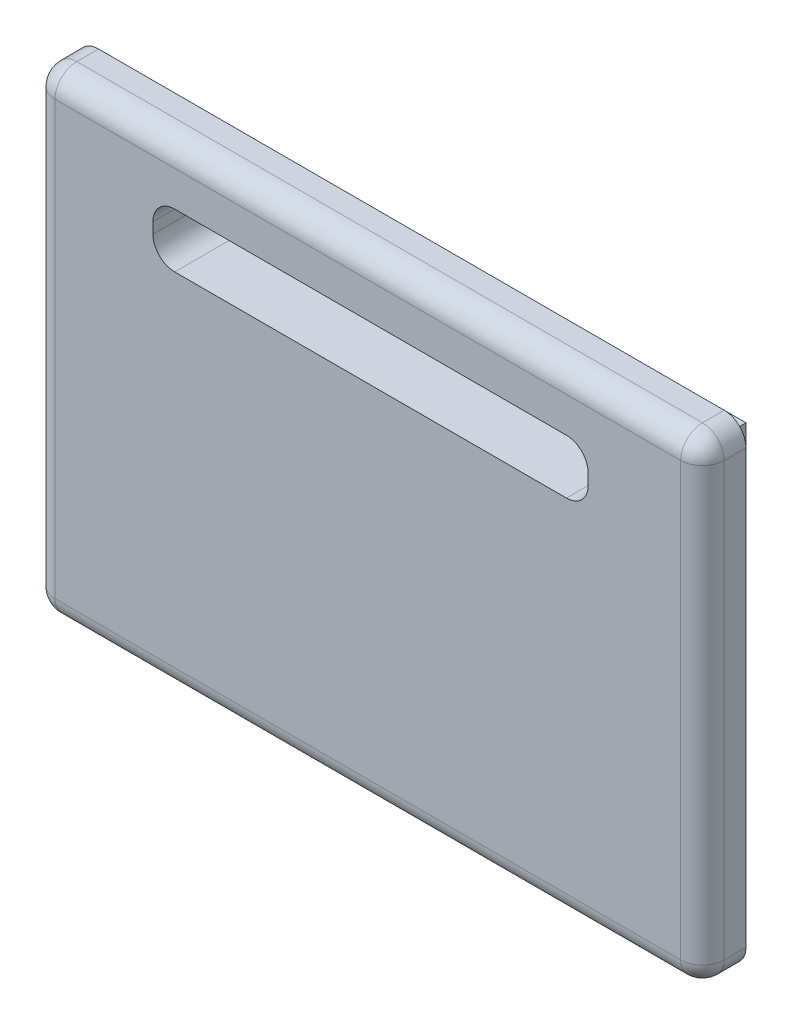
ISO-10303-21;
HEADER;
FILE_DESCRIPTION(('STEP AP214'),'2;1');
FILE_NAME('part.step','',(''),(''),'','','');
FILE_SCHEMA(('AUTOMOTIVE_DESIGN { 1 0 10303 214 1 1 1 1 }'));
ENDSEC;
DATA;
#1=APPLICATION_CONTEXT('core data for automotive mechanical design processes');
#2=APPLICATION_PROTOCOL_DEFINITION('international standard','automotive_design',2000,#1);
#3=PRODUCT_CONTEXT('',#1,'mechanical');
#4=PRODUCT('Part','Part','',(#3));
#5=PRODUCT_RELATED_PRODUCT_CATEGORY('part','',(#4));
#6=PRODUCT_DEFINITION_FORMATION('','',#4);
#7=PRODUCT_DEFINITION_CONTEXT('part definition',#1,'design');
#8=PRODUCT_DEFINITION('design','',#6,#7);
#9=PRODUCT_DEFINITION_SHAPE('','',#8);
#10=(LENGTH_UNIT() NAMED_UNIT(*) SI_UNIT(.MILLI.,.METRE.));
#11=(NAMED_UNIT(*) PLANE_ANGLE_UNIT() SI_UNIT($,.RADIAN.));
#12=(NAMED_UNIT(*) SI_UNIT($,.STERADIAN.) SOLID_ANGLE_UNIT());
#13=UNCERTAINTY_MEASURE_WITH_UNIT(LENGTH_MEASURE(1.E-05),#10,'distance_accuracy_value','');
#14=(GEOMETRIC_REPRESENTATION_CONTEXT(3) GLOBAL_UNCERTAINTY_ASSIGNED_CONTEXT((#13)) GLOBAL_UNIT_ASSIGNED_CONTEXT((#10,
#11,#12)) REPRESENTATION_CONTEXT('',''));
#15=CARTESIAN_POINT('',(0.,0.,0.));
#16=DIRECTION('',(0.,0.,1.));
#17=DIRECTION('',(1.,0.,0.));
#18=AXIS2_PLACEMENT_3D('',#15,#16,#17);
#19=CARTESIAN_POINT('',(0.,0.,0.));
#20=DIRECTION('',(0.,0.,1.));
#21=DIRECTION('',(1.,0.,0.));
#22=AXIS2_PLACEMENT_3D('',#19,#20,#21);
#23=PLANE('',#22);
#24=DIRECTION('',(0.,-1.,0.));
#25=VECTOR('',#24,1.);
#26=CARTESIAN_POINT('',(-21.5226912327314,22.8150411802114,0.));
#27=LINE('',#26,#25);
#28=CARTESIAN_POINT('',(-21.5226912327314,20.8150411802114,0.));
#29=VERTEX_POINT('',#28);
#30=CARTESIAN_POINT('',(-21.5226912327314,-18.9349588197886,0.));
#31=VERTEX_POINT('',#30);
#32=EDGE_CURVE('E208',#29,#31,#27,.T.);
#33=ORIENTED_EDGE('',*,*,#32,.F.);
#34=CARTESIAN_POINT('',(-19.5226912327314,20.8150411802114,0.));
#35=DIRECTION('',(0.,0.,1.));
#36=DIRECTION('',(1.,0.,0.));
#37=AXIS2_PLACEMENT_3D('',#34,#35,#36);
#38=CIRCLE('',#37,2.);
#39=CARTESIAN_POINT('',(-19.5226912327314,22.8150411802114,0.));
#40=VERTEX_POINT('',#39);
#41=EDGE_CURVE('E265',#29,#40,#38,.F.);
#42=ORIENTED_EDGE('',*,*,#41,.T.);
#43=DIRECTION('',(-1.,0.,0.));
#44=VECTOR('',#43,1.);
#45=CARTESIAN_POINT('',(-21.5226912327314,22.8150411802114,0.));
#46=LINE('',#45,#44);
#47=CARTESIAN_POINT('',(37.9773087672686,22.8150411802114,0.));
#48=VERTEX_POINT('',#47);
#49=EDGE_CURVE('E222',#48,#40,#46,.T.);
#50=ORIENTED_EDGE('',*,*,#49,.F.);
#51=CARTESIAN_POINT('',(37.9773087672686,20.8150411802114,0.));
#52=DIRECTION('',(0.,0.,1.));
#53=DIRECTION('',(1.,0.,0.));
#54=AXIS2_PLACEMENT_3D('',#51,#52,#53);
#55=CIRCLE('',#54,2.);
#56=CARTESIAN_POINT('',(39.9773087672686,20.8150411802114,0.));
#57=VERTEX_POINT('',#56);
#58=EDGE_CURVE('E259',#48,#57,#55,.F.);
#59=ORIENTED_EDGE('',*,*,#58,.T.);
#60=DIRECTION('',(0.,1.,0.));
#61=VECTOR('',#60,1.);
#62=CARTESIAN_POINT('',(39.9773087672686,22.8150411802114,0.));
#63=LINE('',#62,#61);
#64=CARTESIAN_POINT('',(39.9773087672686,-18.9349588197886,0.));
#65=VERTEX_POINT('',#64);
#66=EDGE_CURVE('E219',#65,#57,#63,.T.);
#67=ORIENTED_EDGE('',*,*,#66,.F.);
#68=CARTESIAN_POINT('',(37.9773087672686,-18.9349588197886,0.));
#69=DIRECTION('',(0.,0.,1.));
#70=DIRECTION('',(1.,0.,0.));
#71=AXIS2_PLACEMENT_3D('',#68,#69,#70);
#72=CIRCLE('',#71,2.);
#73=CARTESIAN_POINT('',(37.9773087672686,-20.9349588197886,0.));
#74=VERTEX_POINT('',#73);
#75=EDGE_CURVE('E261',#65,#74,#72,.F.);
#76=ORIENTED_EDGE('',*,*,#75,.T.);
#77=DIRECTION('',(1.,0.,0.));
#78=VECTOR('',#77,1.);
#79=CARTESIAN_POINT('',(-21.5226912327314,-20.9349588197886,0.));
#80=LINE('',#79,#78);
#81=CARTESIAN_POINT('',(-19.5226912327314,-20.9349588197886,0.));
#82=VERTEX_POINT('',#81);
#83=EDGE_CURVE('E211',#82,#74,#80,.T.);
#84=ORIENTED_EDGE('',*,*,#83,.F.);
#85=CARTESIAN_POINT('',(-19.5226912327314,-18.9349588197886,0.));
#86=DIRECTION('',(0.,0.,1.));
#87=DIRECTION('',(1.,0.,0.));
#88=AXIS2_PLACEMENT_3D('',#85,#86,#87);
#89=CIRCLE('',#88,2.);
#90=EDGE_CURVE('E263',#82,#31,#89,.F.);
#91=ORIENTED_EDGE('',*,*,#90,.T.);
#92=EDGE_LOOP('',(#33,#42,#50,#59,#67,#76,#84,#91));
#93=FACE_BOUND('',#92,.T.);
#94=DIRECTION('',(0.,1.,0.));
#95=VECTOR('',#94,1.);
#96=CARTESIAN_POINT('',(-17.5226912327314,-16.9349588197886,0.));
#97=LINE('',#96,#95);
#98=CARTESIAN_POINT('',(-17.5226912327314,-16.9349588197886,0.));
#99=VERTEX_POINT('',#98);
#100=CARTESIAN_POINT('',(-17.5226912327314,18.8150411802114,0.));
#101=VERTEX_POINT('',#100);
#102=EDGE_CURVE('E207',#99,#101,#97,.T.);
#103=ORIENTED_EDGE('',*,*,#102,.F.);
#104=DIRECTION('',(-1.,0.,0.));
#105=VECTOR('',#104,1.);
#106=CARTESIAN_POINT('',(-17.5226912327314,-16.9349588197886,0.));
#107=LINE('',#106,#105);
#108=CARTESIAN_POINT('',(35.9773087672686,-16.9349588197886,0.));
#109=VERTEX_POINT('',#108);
#110=EDGE_CURVE('E204',#109,#99,#107,.T.);
#111=ORIENTED_EDGE('',*,*,#110,.F.);
#112=DIRECTION('',(0.,-1.,0.));
#113=VECTOR('',#112,1.);
#114=CARTESIAN_POINT('',(35.9773087672686,-16.9349588197886,0.));
#115=LINE('',#114,#113);
#116=CARTESIAN_POINT('',(35.9773087672686,18.8150411802114,0.));
#117=VERTEX_POINT('',#116);
#118=EDGE_CURVE('E374',#117,#109,#115,.T.);
#119=ORIENTED_EDGE('',*,*,#118,.F.);
#120=DIRECTION('',(1.,0.,0.));
#121=VECTOR('',#120,1.);
#122=CARTESIAN_POINT('',(-17.5226912327314,18.8150411802114,0.));
#123=LINE('',#122,#121);
#124=EDGE_CURVE('E372',#101,#117,#123,.T.);
#125=ORIENTED_EDGE('',*,*,#124,.F.);
#126=EDGE_LOOP('',(#103,#111,#119,#125));
#127=FACE_BOUND('',#126,.T.);
#128=ADVANCED_FACE('F33',(#93,#127),#23,.F.);
#129=CARTESIAN_POINT('',(-21.5226912327314,22.8150411802114,4.));
#130=DIRECTION('',(1.,0.,0.));
#131=DIRECTION('',(0.,0.,-1.));
#132=AXIS2_PLACEMENT_3D('',#129,#130,#131);
#133=PLANE('',#132);
#134=DIRECTION('',(0.,-1.,0.));
#135=VECTOR('',#134,1.);
#136=CARTESIAN_POINT('',(-21.5226912327314,22.8150411802114,2.));
#137=LINE('',#136,#135);
#138=CARTESIAN_POINT('',(-21.5226912327314,-18.9349588197886,2.));
#139=VERTEX_POINT('',#138);
#140=CARTESIAN_POINT('',(-21.5226912327314,20.8150411802114,2.));
#141=VERTEX_POINT('',#140);
#142=EDGE_CURVE('E255',#139,#141,#137,.F.);
#143=ORIENTED_EDGE('',*,*,#142,.T.);
#144=DIRECTION('',(0.,0.,-1.));
#145=VECTOR('',#144,1.);
#146=CARTESIAN_POINT('',(-21.5226912327314,20.8150411802114,4.));
#147=LINE('',#146,#145);
#148=EDGE_CURVE('E257',#141,#29,#147,.T.);
#149=ORIENTED_EDGE('',*,*,#148,.T.);
#150=ORIENTED_EDGE('',*,*,#32,.T.);
#151=DIRECTION('',(0.,0.,-1.));
#152=VECTOR('',#151,1.);
#153=CARTESIAN_POINT('',(-21.5226912327314,-18.9349588197886,4.));
#154=LINE('',#153,#152);
#155=EDGE_CURVE('E253',#31,#139,#154,.F.);
#156=ORIENTED_EDGE('',*,*,#155,.T.);
#157=EDGE_LOOP('',(#143,#149,#150,#156));
#158=FACE_BOUND('',#157,.T.);
#159=ADVANCED_FACE('F387',(#158),#133,.F.);
#160=CARTESIAN_POINT('',(-21.5226912327314,-20.9349588197886,4.));
#161=DIRECTION('',(0.,1.,0.));
#162=DIRECTION('',(0.,0.,1.));
#163=AXIS2_PLACEMENT_3D('',#160,#161,#162);
#164=PLANE('',#163);
#165=DIRECTION('',(1.,0.,0.));
#166=VECTOR('',#165,1.);
#167=CARTESIAN_POINT('',(-21.5226912327314,-20.9349588197886,2.));
#168=LINE('',#167,#166);
#169=CARTESIAN_POINT('',(37.9773087672686,-20.9349588197886,2.));
#170=VERTEX_POINT('',#169);
#171=CARTESIAN_POINT('',(-19.5226912327314,-20.9349588197886,2.));
#172=VERTEX_POINT('',#171);
#173=EDGE_CURVE('E249',#170,#172,#168,.F.);
#174=ORIENTED_EDGE('',*,*,#173,.T.);
#175=DIRECTION('',(0.,0.,-1.));
#176=VECTOR('',#175,1.);
#177=CARTESIAN_POINT('',(-19.5226912327314,-20.9349588197886,4.));
#178=LINE('',#177,#176);
#179=EDGE_CURVE('E251',#172,#82,#178,.T.);
#180=ORIENTED_EDGE('',*,*,#179,.T.);
#181=ORIENTED_EDGE('',*,*,#83,.T.);
#182=DIRECTION('',(0.,0.,-1.));
#183=VECTOR('',#182,1.);
#184=CARTESIAN_POINT('',(37.9773087672686,-20.9349588197886,4.));
#185=LINE('',#184,#183);
#186=EDGE_CURVE('E247',#74,#170,#185,.F.);
#187=ORIENTED_EDGE('',*,*,#186,.T.);
#188=EDGE_LOOP('',(#174,#180,#181,#187));
#189=FACE_BOUND('',#188,.T.);
#190=ADVANCED_FACE('F393',(#189),#164,.F.);
#191=CARTESIAN_POINT('',(39.9773087672686,22.8150411802114,4.));
#192=DIRECTION('',(-1.,0.,0.));
#193=DIRECTION('',(0.,-1.,0.));
#194=AXIS2_PLACEMENT_3D('',#191,#192,#193);
#195=PLANE('',#194);
#196=DIRECTION('',(0.,1.,0.));
#197=VECTOR('',#196,1.);
#198=CARTESIAN_POINT('',(39.9773087672686,-20.9349588197886,2.));
#199=LINE('',#198,#197);
#200=CARTESIAN_POINT('',(39.9773087672686,20.8150411802114,2.));
#201=VERTEX_POINT('',#200);
#202=CARTESIAN_POINT('',(39.9773087672686,-18.9349588197886,2.));
#203=VERTEX_POINT('',#202);
#204=EDGE_CURVE('E243',#201,#203,#199,.F.);
#205=ORIENTED_EDGE('',*,*,#204,.T.);
#206=DIRECTION('',(0.,0.,-1.));
#207=VECTOR('',#206,1.);
#208=CARTESIAN_POINT('',(39.9773087672686,-18.9349588197886,4.));
#209=LINE('',#208,#207);
#210=EDGE_CURVE('E245',#203,#65,#209,.T.);
#211=ORIENTED_EDGE('',*,*,#210,.T.);
#212=ORIENTED_EDGE('',*,*,#66,.T.);
#213=DIRECTION('',(0.,0.,-1.));
#214=VECTOR('',#213,1.);
#215=CARTESIAN_POINT('',(39.9773087672686,20.8150411802114,4.));
#216=LINE('',#215,#214);
#217=EDGE_CURVE('E241',#57,#201,#216,.F.);
#218=ORIENTED_EDGE('',*,*,#217,.T.);
#219=EDGE_LOOP('',(#205,#211,#212,#218));
#220=FACE_BOUND('',#219,.T.);
#221=ADVANCED_FACE('F403',(#220),#195,.F.);
#222=CARTESIAN_POINT('',(-21.5226912327314,22.8150411802114,4.));
#223=DIRECTION('',(0.,-1.,0.));
#224=DIRECTION('',(0.,0.,-1.));
#225=AXIS2_PLACEMENT_3D('',#222,#223,#224);
#226=PLANE('',#225);
#227=ORIENTED_EDGE('',*,*,#49,.T.);
#228=DIRECTION('',(0.,0.,-1.));
#229=VECTOR('',#228,1.);
#230=CARTESIAN_POINT('',(-19.5226912327314,22.8150411802114,4.));
#231=LINE('',#230,#229);
#232=CARTESIAN_POINT('',(-19.5226912327314,22.8150411802114,2.));
#233=VERTEX_POINT('',#232);
#234=EDGE_CURVE('E239',#40,#233,#231,.F.);
#235=ORIENTED_EDGE('',*,*,#234,.T.);
#236=DIRECTION('',(-1.,0.,0.));
#237=VECTOR('',#236,1.);
#238=CARTESIAN_POINT('',(39.9773087672686,22.8150411802114,2.));
#239=LINE('',#238,#237);
#240=CARTESIAN_POINT('',(37.9773087672686,22.8150411802114,2.));
#241=VERTEX_POINT('',#240);
#242=EDGE_CURVE('E236',#233,#241,#239,.F.);
#243=ORIENTED_EDGE('',*,*,#242,.T.);
#244=DIRECTION('',(0.,0.,-1.));
#245=VECTOR('',#244,1.);
#246=CARTESIAN_POINT('',(37.9773087672686,22.8150411802114,4.));
#247=LINE('',#246,#245);
#248=EDGE_CURVE('E234',#241,#48,#247,.T.);
#249=ORIENTED_EDGE('',*,*,#248,.T.);
#250=EDGE_LOOP('',(#227,#235,#243,#249));
#251=FACE_BOUND('',#250,.T.);
#252=ADVANCED_FACE('F400',(#251),#226,.F.);
#253=CARTESIAN_POINT('',(0.,0.,4.));
#254=DIRECTION('',(0.,0.,1.));
#255=DIRECTION('',(1.,0.,0.));
#256=AXIS2_PLACEMENT_3D('',#253,#254,#255);
#257=PLANE('',#256);
#258=DIRECTION('',(0.,-1.,0.));
#259=VECTOR('',#258,1.);
#260=CARTESIAN_POINT('',(-10.5226912327314,17.5722355382113,4.));
#261=LINE('',#260,#259);
#262=CARTESIAN_POINT('',(-10.5226912327314,15.5722355382113,4.));
#263=VERTEX_POINT('',#262);
#264=CARTESIAN_POINT('',(-10.5226912327314,14.5722355382113,4.));
#265=VERTEX_POINT('',#264);
#266=EDGE_CURVE('E358',#263,#265,#261,.T.);
#267=ORIENTED_EDGE('',*,*,#266,.F.);
#268=CARTESIAN_POINT('',(-8.52269123273136,15.5722355382113,4.));
#269=DIRECTION('',(0.,0.,1.));
#270=DIRECTION('',(1.,0.,0.));
#271=AXIS2_PLACEMENT_3D('',#268,#269,#270);
#272=CIRCLE('',#271,2.);
#273=CARTESIAN_POINT('',(-8.52269123273136,17.5722355382113,4.));
#274=VERTEX_POINT('',#273);
#275=EDGE_CURVE('E325',#263,#274,#272,.F.);
#276=ORIENTED_EDGE('',*,*,#275,.T.);
#277=DIRECTION('',(-1.,0.,0.));
#278=VECTOR('',#277,1.);
#279=CARTESIAN_POINT('',(-10.5226912327314,17.5722355382113,4.));
#280=LINE('',#279,#278);
#281=CARTESIAN_POINT('',(27.4773087672686,17.5722355382113,4.));
#282=VERTEX_POINT('',#281);
#283=EDGE_CURVE('E339',#282,#274,#280,.T.);
#284=ORIENTED_EDGE('',*,*,#283,.F.);
#285=CARTESIAN_POINT('',(27.4773087672686,15.5722355382113,4.));
#286=DIRECTION('',(0.,0.,1.));
#287=DIRECTION('',(1.,0.,0.));
#288=AXIS2_PLACEMENT_3D('',#285,#286,#287);
#289=CIRCLE('',#288,2.);
#290=CARTESIAN_POINT('',(29.4773087672686,15.5722355382113,4.));
#291=VERTEX_POINT('',#290);
#292=EDGE_CURVE('E41',#282,#291,#289,.F.);
#293=ORIENTED_EDGE('',*,*,#292,.T.);
#294=DIRECTION('',(0.,1.,0.));
#295=VECTOR('',#294,1.);
#296=CARTESIAN_POINT('',(29.4773087672686,17.5722355382113,4.));
#297=LINE('',#296,#295);
#298=CARTESIAN_POINT('',(29.4773087672686,14.5722355382113,4.));
#299=VERTEX_POINT('',#298);
#300=EDGE_CURVE('E337',#299,#291,#297,.T.);
#301=ORIENTED_EDGE('',*,*,#300,.F.);
#302=CARTESIAN_POINT('',(27.4773087672686,14.5722355382113,4.));
#303=DIRECTION('',(0.,0.,1.));
#304=DIRECTION('',(1.,0.,0.));
#305=AXIS2_PLACEMENT_3D('',#302,#303,#304);
#306=CIRCLE('',#305,2.);
#307=CARTESIAN_POINT('',(27.4773087672686,12.5722355382113,4.));
#308=VERTEX_POINT('',#307);
#309=EDGE_CURVE('E329',#299,#308,#306,.F.);
#310=ORIENTED_EDGE('',*,*,#309,.T.);
#311=DIRECTION('',(1.,0.,0.));
#312=VECTOR('',#311,1.);
#313=CARTESIAN_POINT('',(-10.5226912327314,12.5722355382113,4.));
#314=LINE('',#313,#312);
#315=CARTESIAN_POINT('',(-8.52269123273136,12.5722355382113,4.));
#316=VERTEX_POINT('',#315);
#317=EDGE_CURVE('E344',#316,#308,#314,.T.);
#318=ORIENTED_EDGE('',*,*,#317,.F.);
#319=CARTESIAN_POINT('',(-8.52269123273136,14.5722355382113,4.));
#320=DIRECTION('',(0.,0.,1.));
#321=DIRECTION('',(1.,0.,0.));
#322=AXIS2_PLACEMENT_3D('',#319,#320,#321);
#323=CIRCLE('',#322,2.);
#324=EDGE_CURVE('E321',#316,#265,#323,.F.);
#325=ORIENTED_EDGE('',*,*,#324,.T.);
#326=EDGE_LOOP('',(#267,#276,#284,#293,#301,#310,#318,#325));
#327=FACE_BOUND('',#326,.T.);
#328=DIRECTION('',(0.,1.,0.));
#329=VECTOR('',#328,1.);
#330=CARTESIAN_POINT('',(37.9773087672686,22.8150411802114,4.));
#331=LINE('',#330,#329);
#332=CARTESIAN_POINT('',(37.9773087672686,-18.9349588197886,4.));
#333=VERTEX_POINT('',#332);
#334=CARTESIAN_POINT('',(37.9773087672686,20.8150411802114,4.));
#335=VERTEX_POINT('',#334);
#336=EDGE_CURVE('E229',#333,#335,#331,.T.);
#337=ORIENTED_EDGE('',*,*,#336,.T.);
#338=DIRECTION('',(-1.,0.,0.));
#339=VECTOR('',#338,1.);
#340=CARTESIAN_POINT('',(-21.5226912327314,20.8150411802114,4.));
#341=LINE('',#340,#339);
#342=CARTESIAN_POINT('',(-19.5226912327314,20.8150411802114,4.));
#343=VERTEX_POINT('',#342);
#344=EDGE_CURVE('E231',#335,#343,#341,.T.);
#345=ORIENTED_EDGE('',*,*,#344,.T.);
#346=DIRECTION('',(0.,-1.,0.));
#347=VECTOR('',#346,1.);
#348=CARTESIAN_POINT('',(-19.5226912327314,-20.9349588197886,4.));
#349=LINE('',#348,#347);
#350=CARTESIAN_POINT('',(-19.5226912327314,-18.9349588197886,4.));
#351=VERTEX_POINT('',#350);
#352=EDGE_CURVE('E225',#343,#351,#349,.T.);
#353=ORIENTED_EDGE('',*,*,#352,.T.);
#354=DIRECTION('',(1.,0.,0.));
#355=VECTOR('',#354,1.);
#356=CARTESIAN_POINT('',(39.9773087672686,-18.9349588197886,4.));
#357=LINE('',#356,#355);
#358=EDGE_CURVE('E227',#351,#333,#357,.T.);
#359=ORIENTED_EDGE('',*,*,#358,.T.);
#360=EDGE_LOOP('',(#337,#345,#353,#359));
#361=FACE_BOUND('',#360,.T.);
#362=ADVANCED_FACE('F335',(#327,#361),#257,.T.);
#363=CARTESIAN_POINT('',(-17.5226912327314,-16.9349588197886,-4.));
#364=DIRECTION('',(1.,0.,0.));
#365=DIRECTION('',(0.,0.,-1.));
#366=AXIS2_PLACEMENT_3D('',#363,#364,#365);
#367=PLANE('',#366);
#368=ORIENTED_EDGE('',*,*,#102,.T.);
#369=DIRECTION('',(0.,0.,1.));
#370=VECTOR('',#369,1.);
#371=CARTESIAN_POINT('',(-17.5226912327314,18.8150411802114,-4.));
#372=LINE('',#371,#370);
#373=CARTESIAN_POINT('',(-17.5226912327314,18.8150411802114,-4.));
#374=VERTEX_POINT('',#373);
#375=EDGE_CURVE('E188',#374,#101,#372,.T.);
#376=ORIENTED_EDGE('',*,*,#375,.F.);
#377=DIRECTION('',(0.,1.,0.));
#378=VECTOR('',#377,1.);
#379=CARTESIAN_POINT('',(-17.5226912327314,-16.9349588197886,-4.));
#380=LINE('',#379,#378);
#381=CARTESIAN_POINT('',(-17.5226912327314,-16.9349588197886,-4.));
#382=VERTEX_POINT('',#381);
#383=EDGE_CURVE('E195',#382,#374,#380,.T.);
#384=ORIENTED_EDGE('',*,*,#383,.F.);
#385=DIRECTION('',(0.,0.,1.));
#386=VECTOR('',#385,1.);
#387=CARTESIAN_POINT('',(-17.5226912327314,-16.9349588197886,-4.));
#388=LINE('',#387,#386);
#389=EDGE_CURVE('E370',#382,#99,#388,.T.);
#390=ORIENTED_EDGE('',*,*,#389,.T.);
#391=EDGE_LOOP('',(#368,#376,#384,#390));
#392=FACE_BOUND('',#391,.T.);
#393=ADVANCED_FACE('F206',(#392),#367,.F.);
#394=CARTESIAN_POINT('',(-17.5226912327314,18.8150411802114,-4.));
#395=DIRECTION('',(0.,-1.,0.));
#396=DIRECTION('',(1.,0.,0.));
#397=AXIS2_PLACEMENT_3D('',#394,#395,#396);
#398=PLANE('',#397);
#399=ORIENTED_EDGE('',*,*,#124,.T.);
#400=DIRECTION('',(0.,0.,1.));
#401=VECTOR('',#400,1.);
#402=CARTESIAN_POINT('',(35.9773087672686,18.8150411802114,-4.));
#403=LINE('',#402,#401);
#404=CARTESIAN_POINT('',(35.9773087672686,18.8150411802114,-4.));
#405=VERTEX_POINT('',#404);
#406=EDGE_CURVE('E191',#405,#117,#403,.T.);
#407=ORIENTED_EDGE('',*,*,#406,.F.);
#408=DIRECTION('',(1.,0.,0.));
#409=VECTOR('',#408,1.);
#410=CARTESIAN_POINT('',(-17.5226912327314,18.8150411802114,-4.));
#411=LINE('',#410,#409);
#412=EDGE_CURVE('E183',#374,#405,#411,.T.);
#413=ORIENTED_EDGE('',*,*,#412,.F.);
#414=ORIENTED_EDGE('',*,*,#375,.T.);
#415=EDGE_LOOP('',(#399,#407,#413,#414));
#416=FACE_BOUND('',#415,.T.);
#417=ADVANCED_FACE('F186',(#416),#398,.F.);
#418=CARTESIAN_POINT('',(35.9773087672686,-16.9349588197886,-4.));
#419=DIRECTION('',(-1.,0.,0.));
#420=DIRECTION('',(0.,0.,1.));
#421=AXIS2_PLACEMENT_3D('',#418,#419,#420);
#422=PLANE('',#421);
#423=ORIENTED_EDGE('',*,*,#118,.T.);
#424=DIRECTION('',(0.,0.,1.));
#425=VECTOR('',#424,1.);
#426=CARTESIAN_POINT('',(35.9773087672686,-16.9349588197886,-4.));
#427=LINE('',#426,#425);
#428=CARTESIAN_POINT('',(35.9773087672686,-16.9349588197886,-4.));
#429=VERTEX_POINT('',#428);
#430=EDGE_CURVE('E213',#429,#109,#427,.T.);
#431=ORIENTED_EDGE('',*,*,#430,.F.);
#432=DIRECTION('',(0.,-1.,0.));
#433=VECTOR('',#432,1.);
#434=CARTESIAN_POINT('',(35.9773087672686,-16.9349588197886,-4.));
#435=LINE('',#434,#433);
#436=EDGE_CURVE('E194',#405,#429,#435,.T.);
#437=ORIENTED_EDGE('',*,*,#436,.F.);
#438=ORIENTED_EDGE('',*,*,#406,.T.);
#439=EDGE_LOOP('',(#423,#431,#437,#438));
#440=FACE_BOUND('',#439,.T.);
#441=ADVANCED_FACE('F384',(#440),#422,.F.);
#442=CARTESIAN_POINT('',(-17.5226912327314,-16.9349588197886,-4.));
#443=DIRECTION('',(0.,1.,0.));
#444=DIRECTION('',(-1.,0.,0.));
#445=AXIS2_PLACEMENT_3D('',#442,#443,#444);
#446=PLANE('',#445);
#447=ORIENTED_EDGE('',*,*,#110,.T.);
#448=ORIENTED_EDGE('',*,*,#389,.F.);
#449=DIRECTION('',(-1.,0.,0.));
#450=VECTOR('',#449,1.);
#451=CARTESIAN_POINT('',(-17.5226912327314,-16.9349588197886,-4.));
#452=LINE('',#451,#450);
#453=EDGE_CURVE('E200',#429,#382,#452,.T.);
#454=ORIENTED_EDGE('',*,*,#453,.F.);
#455=ORIENTED_EDGE('',*,*,#430,.T.);
#456=EDGE_LOOP('',(#447,#448,#454,#455));
#457=FACE_BOUND('',#456,.T.);
#458=ADVANCED_FACE('F382',(#457),#446,.F.);
#459=CARTESIAN_POINT('',(0.,0.,-4.));
#460=DIRECTION('',(0.,0.,-1.));
#461=DIRECTION('',(-1.,0.,0.));
#462=AXIS2_PLACEMENT_3D('',#459,#460,#461);
#463=PLANE('',#462);
#464=DIRECTION('',(-1.,0.,0.));
#465=VECTOR('',#464,1.);
#466=CARTESIAN_POINT('',(-10.5226912327314,17.5722355382113,-4.));
#467=LINE('',#466,#465);
#468=CARTESIAN_POINT('',(27.4773087672686,17.5722355382113,-4.));
#469=VERTEX_POINT('',#468);
#470=CARTESIAN_POINT('',(-8.52269123273136,17.5722355382113,-4.));
#471=VERTEX_POINT('',#470);
#472=EDGE_CURVE('E349',#469,#471,#467,.T.);
#473=ORIENTED_EDGE('',*,*,#472,.T.);
#474=CARTESIAN_POINT('',(-8.52269123273136,15.5722355382113,-4.));
#475=DIRECTION('',(0.,0.,-1.));
#476=DIRECTION('',(-1.,0.,0.));
#477=AXIS2_PLACEMENT_3D('',#474,#475,#476);
#478=CIRCLE('',#477,2.);
#479=CARTESIAN_POINT('',(-10.5226912327314,15.5722355382113,-4.));
#480=VERTEX_POINT('',#479);
#481=EDGE_CURVE('E327',#471,#480,#478,.F.);
#482=ORIENTED_EDGE('',*,*,#481,.T.);
#483=DIRECTION('',(0.,-1.,0.));
#484=VECTOR('',#483,1.);
#485=CARTESIAN_POINT('',(-10.5226912327314,17.5722355382113,-4.));
#486=LINE('',#485,#484);
#487=CARTESIAN_POINT('',(-10.5226912327314,14.5722355382113,-4.));
#488=VERTEX_POINT('',#487);
#489=EDGE_CURVE('E355',#480,#488,#486,.T.);
#490=ORIENTED_EDGE('',*,*,#489,.T.);
#491=CARTESIAN_POINT('',(-8.52269123273136,14.5722355382113,-4.));
#492=DIRECTION('',(0.,0.,-1.));
#493=DIRECTION('',(-1.,0.,0.));
#494=AXIS2_PLACEMENT_3D('',#491,#492,#493);
#495=CIRCLE('',#494,2.);
#496=CARTESIAN_POINT('',(-8.52269123273136,12.5722355382113,-4.));
#497=VERTEX_POINT('',#496);
#498=EDGE_CURVE('E323',#488,#497,#495,.F.);
#499=ORIENTED_EDGE('',*,*,#498,.T.);
#500=DIRECTION('',(1.,0.,0.));
#501=VECTOR('',#500,1.);
#502=CARTESIAN_POINT('',(-10.5226912327314,12.5722355382113,-4.));
#503=LINE('',#502,#501);
#504=CARTESIAN_POINT('',(27.4773087672686,12.5722355382113,-4.));
#505=VERTEX_POINT('',#504);
#506=EDGE_CURVE('E271',#497,#505,#503,.T.);
#507=ORIENTED_EDGE('',*,*,#506,.T.);
#508=CARTESIAN_POINT('',(27.4773087672686,14.5722355382113,-4.));
#509=DIRECTION('',(0.,0.,-1.));
#510=DIRECTION('',(-1.,0.,0.));
#511=AXIS2_PLACEMENT_3D('',#508,#509,#510);
#512=CIRCLE('',#511,2.);
#513=CARTESIAN_POINT('',(29.4773087672686,14.5722355382113,-4.));
#514=VERTEX_POINT('',#513);
#515=EDGE_CURVE('E55',#505,#514,#512,.F.);
#516=ORIENTED_EDGE('',*,*,#515,.T.);
#517=DIRECTION('',(0.,1.,0.));
#518=VECTOR('',#517,1.);
#519=CARTESIAN_POINT('',(29.4773087672686,17.5722355382113,-4.));
#520=LINE('',#519,#518);
#521=CARTESIAN_POINT('',(29.4773087672686,15.5722355382113,-4.));
#522=VERTEX_POINT('',#521);
#523=EDGE_CURVE('E351',#514,#522,#520,.T.);
#524=ORIENTED_EDGE('',*,*,#523,.T.);
#525=CARTESIAN_POINT('',(27.4773087672686,15.5722355382113,-4.));
#526=DIRECTION('',(0.,0.,-1.));
#527=DIRECTION('',(-1.,0.,0.));
#528=AXIS2_PLACEMENT_3D('',#525,#526,#527);
#529=CIRCLE('',#528,2.);
#530=EDGE_CURVE('E11',#522,#469,#529,.F.);
#531=ORIENTED_EDGE('',*,*,#530,.T.);
#532=EDGE_LOOP('',(#473,#482,#490,#499,#507,#516,#524,#531));
#533=FACE_BOUND('',#532,.T.);
#534=ORIENTED_EDGE('',*,*,#383,.T.);
#535=ORIENTED_EDGE('',*,*,#412,.T.);
#536=ORIENTED_EDGE('',*,*,#436,.T.);
#537=ORIENTED_EDGE('',*,*,#453,.T.);
#538=EDGE_LOOP('',(#534,#535,#536,#537));
#539=FACE_BOUND('',#538,.T.);
#540=ADVANCED_FACE('F198',(#533,#539),#463,.T.);
#541=CARTESIAN_POINT('',(37.9773087672686,-18.9349588197886,4.));
#542=DIRECTION('',(0.,0.,-1.));
#543=DIRECTION('',(-1.,0.,0.));
#544=AXIS2_PLACEMENT_3D('',#541,#542,#543);
#545=CYLINDRICAL_SURFACE('',#544,2.);
#546=ORIENTED_EDGE('',*,*,#75,.F.);
#547=ORIENTED_EDGE('',*,*,#210,.F.);
#548=CARTESIAN_POINT('',(37.9773087672686,-18.9349588197886,2.));
#549=DIRECTION('',(0.,0.,1.));
#550=DIRECTION('',(1.,0.,0.));
#551=AXIS2_PLACEMENT_3D('',#548,#549,#550);
#552=CIRCLE('',#551,2.);
#553=EDGE_CURVE('E300',#170,#203,#552,.T.);
#554=ORIENTED_EDGE('',*,*,#553,.F.);
#555=ORIENTED_EDGE('',*,*,#186,.F.);
#556=EDGE_LOOP('',(#546,#547,#554,#555));
#557=FACE_BOUND('',#556,.T.);
#558=ADVANCED_FACE('F455',(#557),#545,.T.);
#559=CARTESIAN_POINT('',(0.,-18.9349588197886,2.));
#560=DIRECTION('',(-1.,0.,0.));
#561=DIRECTION('',(0.,0.,1.));
#562=AXIS2_PLACEMENT_3D('',#559,#560,#561);
#563=CYLINDRICAL_SURFACE('',#562,2.);
#564=CARTESIAN_POINT('',(-19.5226912327314,-18.9349588197886,2.));
#565=DIRECTION('',(-1.,0.,0.));
#566=DIRECTION('',(0.,0.,1.));
#567=AXIS2_PLACEMENT_3D('',#564,#565,#566);
#568=CIRCLE('',#567,2.);
#569=EDGE_CURVE('E294',#172,#351,#568,.T.);
#570=ORIENTED_EDGE('',*,*,#569,.F.);
#571=ORIENTED_EDGE('',*,*,#173,.F.);
#572=CARTESIAN_POINT('',(37.9773087672686,-18.9349588197886,2.));
#573=DIRECTION('',(1.,0.,0.));
#574=DIRECTION('',(0.,0.,-1.));
#575=AXIS2_PLACEMENT_3D('',#572,#573,#574);
#576=CIRCLE('',#575,2.);
#577=EDGE_CURVE('E297',#333,#170,#576,.T.);
#578=ORIENTED_EDGE('',*,*,#577,.F.);
#579=ORIENTED_EDGE('',*,*,#358,.F.);
#580=EDGE_LOOP('',(#570,#571,#578,#579));
#581=FACE_BOUND('',#580,.T.);
#582=ADVANCED_FACE('F451',(#581),#563,.T.);
#583=CARTESIAN_POINT('',(-19.5226912327314,-18.9349588197886,4.));
#584=DIRECTION('',(0.,0.,-1.));
#585=DIRECTION('',(-1.,0.,0.));
#586=AXIS2_PLACEMENT_3D('',#583,#584,#585);
#587=CYLINDRICAL_SURFACE('',#586,2.);
#588=ORIENTED_EDGE('',*,*,#90,.F.);
#589=ORIENTED_EDGE('',*,*,#179,.F.);
#590=CARTESIAN_POINT('',(-19.5226912327314,-18.9349588197886,2.));
#591=DIRECTION('',(0.,0.,1.));
#592=DIRECTION('',(1.,0.,0.));
#593=AXIS2_PLACEMENT_3D('',#590,#591,#592);
#594=CIRCLE('',#593,2.);
#595=EDGE_CURVE('E291',#139,#172,#594,.T.);
#596=ORIENTED_EDGE('',*,*,#595,.F.);
#597=ORIENTED_EDGE('',*,*,#155,.F.);
#598=EDGE_LOOP('',(#588,#589,#596,#597));
#599=FACE_BOUND('',#598,.T.);
#600=ADVANCED_FACE('F447',(#599),#587,.T.);
#601=CARTESIAN_POINT('',(37.9773087672686,-18.9349588197886,2.));
#602=DIRECTION('',(0.,0.,1.));
#603=DIRECTION('',(1.,0.,0.));
#604=AXIS2_PLACEMENT_3D('',#601,#602,#603);
#605=SPHERICAL_SURFACE('',#604,2.);
#606=ORIENTED_EDGE('',*,*,#577,.T.);
#607=ORIENTED_EDGE('',*,*,#553,.T.);
#608=CARTESIAN_POINT('',(37.9773087672686,-18.9349588197886,2.));
#609=DIRECTION('',(0.,-1.,0.));
#610=DIRECTION('',(0.,0.,-1.));
#611=AXIS2_PLACEMENT_3D('',#608,#609,#610);
#612=CIRCLE('',#611,2.);
#613=EDGE_CURVE('E288',#333,#203,#612,.F.);
#614=ORIENTED_EDGE('',*,*,#613,.F.);
#615=EDGE_LOOP('',(#606,#607,#614));
#616=FACE_BOUND('',#615,.T.);
#617=ADVANCED_FACE('F443',(#616),#605,.T.);
#618=CARTESIAN_POINT('',(-19.5226912327314,-18.9349588197886,2.));
#619=DIRECTION('',(0.,0.,1.));
#620=DIRECTION('',(1.,0.,0.));
#621=AXIS2_PLACEMENT_3D('',#618,#619,#620);
#622=SPHERICAL_SURFACE('',#621,2.);
#623=ORIENTED_EDGE('',*,*,#595,.T.);
#624=ORIENTED_EDGE('',*,*,#569,.T.);
#625=CARTESIAN_POINT('',(-19.5226912327314,-18.9349588197886,2.));
#626=DIRECTION('',(0.,-1.,0.));
#627=DIRECTION('',(0.,0.,-1.));
#628=AXIS2_PLACEMENT_3D('',#625,#626,#627);
#629=CIRCLE('',#628,2.);
#630=EDGE_CURVE('E285',#139,#351,#629,.F.);
#631=ORIENTED_EDGE('',*,*,#630,.F.);
#632=EDGE_LOOP('',(#623,#624,#631));
#633=FACE_BOUND('',#632,.T.);
#634=ADVANCED_FACE('F439',(#633),#622,.T.);
#635=CARTESIAN_POINT('',(37.9773087672686,20.8150411802114,4.));
#636=DIRECTION('',(0.,0.,-1.));
#637=DIRECTION('',(-1.,0.,0.));
#638=AXIS2_PLACEMENT_3D('',#635,#636,#637);
#639=CYLINDRICAL_SURFACE('',#638,2.);
#640=ORIENTED_EDGE('',*,*,#58,.F.);
#641=ORIENTED_EDGE('',*,*,#248,.F.);
#642=CARTESIAN_POINT('',(37.9773087672686,20.8150411802114,2.));
#643=DIRECTION('',(0.,0.,1.));
#644=DIRECTION('',(1.,0.,0.));
#645=AXIS2_PLACEMENT_3D('',#642,#643,#644);
#646=CIRCLE('',#645,2.);
#647=EDGE_CURVE('E282',#201,#241,#646,.T.);
#648=ORIENTED_EDGE('',*,*,#647,.F.);
#649=ORIENTED_EDGE('',*,*,#217,.F.);
#650=EDGE_LOOP('',(#640,#641,#648,#649));
#651=FACE_BOUND('',#650,.T.);
#652=ADVANCED_FACE('F435',(#651),#639,.T.);
#653=CARTESIAN_POINT('',(37.9773087672686,0.,2.));
#654=DIRECTION('',(0.,-1.,0.));
#655=DIRECTION('',(1.,0.,0.));
#656=AXIS2_PLACEMENT_3D('',#653,#654,#655);
#657=CYLINDRICAL_SURFACE('',#656,2.);
#658=ORIENTED_EDGE('',*,*,#613,.T.);
#659=ORIENTED_EDGE('',*,*,#204,.F.);
#660=CARTESIAN_POINT('',(37.9773087672686,20.8150411802114,2.));
#661=DIRECTION('',(0.,1.,0.));
#662=DIRECTION('',(0.,0.,1.));
#663=AXIS2_PLACEMENT_3D('',#660,#661,#662);
#664=CIRCLE('',#663,2.);
#665=EDGE_CURVE('E279',#335,#201,#664,.T.);
#666=ORIENTED_EDGE('',*,*,#665,.F.);
#667=ORIENTED_EDGE('',*,*,#336,.F.);
#668=EDGE_LOOP('',(#658,#659,#666,#667));
#669=FACE_BOUND('',#668,.T.);
#670=ADVANCED_FACE('F431',(#669),#657,.T.);
#671=CARTESIAN_POINT('',(-19.5226912327314,0.,2.));
#672=DIRECTION('',(0.,1.,0.));
#673=DIRECTION('',(0.,0.,1.));
#674=AXIS2_PLACEMENT_3D('',#671,#672,#673);
#675=CYLINDRICAL_SURFACE('',#674,2.);
#676=ORIENTED_EDGE('',*,*,#630,.T.);
#677=ORIENTED_EDGE('',*,*,#352,.F.);
#678=CARTESIAN_POINT('',(-19.5226912327314,20.8150411802114,2.));
#679=DIRECTION('',(0.,1.,0.));
#680=DIRECTION('',(0.,0.,1.));
#681=AXIS2_PLACEMENT_3D('',#678,#679,#680);
#682=CIRCLE('',#681,2.);
#683=EDGE_CURVE('E276',#141,#343,#682,.T.);
#684=ORIENTED_EDGE('',*,*,#683,.F.);
#685=ORIENTED_EDGE('',*,*,#142,.F.);
#686=EDGE_LOOP('',(#676,#677,#684,#685));
#687=FACE_BOUND('',#686,.T.);
#688=ADVANCED_FACE('F427',(#687),#675,.T.);
#689=CARTESIAN_POINT('',(-19.5226912327314,20.8150411802114,4.));
#690=DIRECTION('',(0.,0.,-1.));
#691=DIRECTION('',(-1.,0.,0.));
#692=AXIS2_PLACEMENT_3D('',#689,#690,#691);
#693=CYLINDRICAL_SURFACE('',#692,2.);
#694=ORIENTED_EDGE('',*,*,#41,.F.);
#695=ORIENTED_EDGE('',*,*,#148,.F.);
#696=CARTESIAN_POINT('',(-19.5226912327314,20.8150411802114,2.));
#697=DIRECTION('',(0.,0.,1.));
#698=DIRECTION('',(1.,0.,0.));
#699=AXIS2_PLACEMENT_3D('',#696,#697,#698);
#700=CIRCLE('',#699,2.);
#701=EDGE_CURVE('E273',#233,#141,#700,.T.);
#702=ORIENTED_EDGE('',*,*,#701,.F.);
#703=ORIENTED_EDGE('',*,*,#234,.F.);
#704=EDGE_LOOP('',(#694,#695,#702,#703));
#705=FACE_BOUND('',#704,.T.);
#706=ADVANCED_FACE('F423',(#705),#693,.T.);
#707=CARTESIAN_POINT('',(37.9773087672686,20.8150411802114,2.));
#708=DIRECTION('',(0.,0.,1.));
#709=DIRECTION('',(1.,0.,0.));
#710=AXIS2_PLACEMENT_3D('',#707,#708,#709);
#711=SPHERICAL_SURFACE('',#710,2.);
#712=ORIENTED_EDGE('',*,*,#665,.T.);
#713=ORIENTED_EDGE('',*,*,#647,.T.);
#714=CARTESIAN_POINT('',(37.9773087672686,20.8150411802114,2.));
#715=DIRECTION('',(1.,0.,0.));
#716=DIRECTION('',(0.,0.,-1.));
#717=AXIS2_PLACEMENT_3D('',#714,#715,#716);
#718=CIRCLE('',#717,2.);
#719=EDGE_CURVE('E270',#335,#241,#718,.F.);
#720=ORIENTED_EDGE('',*,*,#719,.F.);
#721=EDGE_LOOP('',(#712,#713,#720));
#722=FACE_BOUND('',#721,.T.);
#723=ADVANCED_FACE('F419',(#722),#711,.T.);
#724=CARTESIAN_POINT('',(-19.5226912327314,20.8150411802114,2.));
#725=DIRECTION('',(0.,0.,1.));
#726=DIRECTION('',(1.,0.,0.));
#727=AXIS2_PLACEMENT_3D('',#724,#725,#726);
#728=SPHERICAL_SURFACE('',#727,2.);
#729=ORIENTED_EDGE('',*,*,#701,.T.);
#730=ORIENTED_EDGE('',*,*,#683,.T.);
#731=CARTESIAN_POINT('',(-19.5226912327314,20.8150411802114,2.));
#732=DIRECTION('',(-1.,0.,0.));
#733=DIRECTION('',(0.,0.,1.));
#734=AXIS2_PLACEMENT_3D('',#731,#732,#733);
#735=CIRCLE('',#734,2.);
#736=EDGE_CURVE('E268',#233,#343,#735,.F.);
#737=ORIENTED_EDGE('',*,*,#736,.F.);
#738=EDGE_LOOP('',(#729,#730,#737));
#739=FACE_BOUND('',#738,.T.);
#740=ADVANCED_FACE('F415',(#739),#728,.T.);
#741=CARTESIAN_POINT('',(0.,20.8150411802114,2.));
#742=DIRECTION('',(1.,0.,0.));
#743=DIRECTION('',(0.,0.,-1.));
#744=AXIS2_PLACEMENT_3D('',#741,#742,#743);
#745=CYLINDRICAL_SURFACE('',#744,2.);
#746=ORIENTED_EDGE('',*,*,#719,.T.);
#747=ORIENTED_EDGE('',*,*,#242,.F.);
#748=ORIENTED_EDGE('',*,*,#736,.T.);
#749=ORIENTED_EDGE('',*,*,#344,.F.);
#750=EDGE_LOOP('',(#746,#747,#748,#749));
#751=FACE_BOUND('',#750,.T.);
#752=ADVANCED_FACE('F411',(#751),#745,.T.);
#753=CARTESIAN_POINT('',(-10.5226912327314,17.5722355382113,-4.001));
#754=DIRECTION('',(-1.,0.,0.));
#755=DIRECTION('',(0.,-1.,0.));
#756=AXIS2_PLACEMENT_3D('',#753,#754,#755);
#757=PLANE('',#756);
#758=ORIENTED_EDGE('',*,*,#266,.T.);
#759=DIRECTION('',(0.,0.,1.));
#760=VECTOR('',#759,1.);
#761=CARTESIAN_POINT('',(-10.5226912327314,14.5722355382113,-4.));
#762=LINE('',#761,#760);
#763=EDGE_CURVE('E310',#265,#488,#762,.F.);
#764=ORIENTED_EDGE('',*,*,#763,.T.);
#765=ORIENTED_EDGE('',*,*,#489,.F.);
#766=DIRECTION('',(0.,0.,1.));
#767=VECTOR('',#766,1.);
#768=CARTESIAN_POINT('',(-10.5226912327314,15.5722355382113,4.));
#769=LINE('',#768,#767);
#770=EDGE_CURVE('E307',#480,#263,#769,.T.);
#771=ORIENTED_EDGE('',*,*,#770,.T.);
#772=EDGE_LOOP('',(#758,#764,#765,#771));
#773=FACE_BOUND('',#772,.T.);
#774=ADVANCED_FACE('F414',(#773),#757,.F.);
#775=CARTESIAN_POINT('',(-10.5226912327314,17.5722355382113,-4.001));
#776=DIRECTION('',(0.,1.,0.));
#777=DIRECTION('',(0.,0.,1.));
#778=AXIS2_PLACEMENT_3D('',#775,#776,#777);
#779=PLANE('',#778);
#780=ORIENTED_EDGE('',*,*,#283,.T.);
#781=DIRECTION('',(0.,0.,1.));
#782=VECTOR('',#781,1.);
#783=CARTESIAN_POINT('',(-8.52269123273136,17.5722355382113,-4.));
#784=LINE('',#783,#782);
#785=EDGE_CURVE('E315',#274,#471,#784,.F.);
#786=ORIENTED_EDGE('',*,*,#785,.T.);
#787=ORIENTED_EDGE('',*,*,#472,.F.);
#788=DIRECTION('',(0.,0.,1.));
#789=VECTOR('',#788,1.);
#790=CARTESIAN_POINT('',(27.4773087672686,17.5722355382113,4.));
#791=LINE('',#790,#789);
#792=EDGE_CURVE('E312',#469,#282,#791,.T.);
#793=ORIENTED_EDGE('',*,*,#792,.T.);
#794=EDGE_LOOP('',(#780,#786,#787,#793));
#795=FACE_BOUND('',#794,.T.);
#796=ADVANCED_FACE('F353',(#795),#779,.F.);
#797=CARTESIAN_POINT('',(29.4773087672686,17.5722355382113,-4.001));
#798=DIRECTION('',(1.,0.,0.));
#799=DIRECTION('',(0.,1.,0.));
#800=AXIS2_PLACEMENT_3D('',#797,#798,#799);
#801=PLANE('',#800);
#802=ORIENTED_EDGE('',*,*,#523,.F.);
#803=DIRECTION('',(0.,0.,1.));
#804=VECTOR('',#803,1.);
#805=CARTESIAN_POINT('',(29.4773087672686,14.5722355382113,4.));
#806=LINE('',#805,#804);
#807=EDGE_CURVE('E318',#514,#299,#806,.T.);
#808=ORIENTED_EDGE('',*,*,#807,.T.);
#809=ORIENTED_EDGE('',*,*,#300,.T.);
#810=DIRECTION('',(0.,0.,1.));
#811=VECTOR('',#810,1.);
#812=CARTESIAN_POINT('',(29.4773087672686,15.5722355382113,-4.));
#813=LINE('',#812,#811);
#814=EDGE_CURVE('E48',#291,#522,#813,.F.);
#815=ORIENTED_EDGE('',*,*,#814,.T.);
#816=EDGE_LOOP('',(#802,#808,#809,#815));
#817=FACE_BOUND('',#816,.T.);
#818=ADVANCED_FACE('F342',(#817),#801,.F.);
#819=CARTESIAN_POINT('',(-10.5226912327314,12.5722355382113,-4.001));
#820=DIRECTION('',(0.,-1.,0.));
#821=DIRECTION('',(1.,0.,0.));
#822=AXIS2_PLACEMENT_3D('',#819,#820,#821);
#823=PLANE('',#822);
#824=ORIENTED_EDGE('',*,*,#506,.F.);
#825=DIRECTION('',(0.,0.,1.));
#826=VECTOR('',#825,1.);
#827=CARTESIAN_POINT('',(-8.52269123273136,12.5722355382113,4.));
#828=LINE('',#827,#826);
#829=EDGE_CURVE('E304',#497,#316,#828,.T.);
#830=ORIENTED_EDGE('',*,*,#829,.T.);
#831=ORIENTED_EDGE('',*,*,#317,.T.);
#832=DIRECTION('',(0.,0.,1.));
#833=VECTOR('',#832,1.);
#834=CARTESIAN_POINT('',(27.4773087672686,12.5722355382113,-4.));
#835=LINE('',#834,#833);
#836=EDGE_CURVE('E267',#308,#505,#835,.F.);
#837=ORIENTED_EDGE('',*,*,#836,.T.);
#838=EDGE_LOOP('',(#824,#830,#831,#837));
#839=FACE_BOUND('',#838,.T.);
#840=ADVANCED_FACE('F464',(#839),#823,.F.);
#841=CARTESIAN_POINT('',(-8.52269123273136,14.5722355382113,-4.001));
#842=DIRECTION('',(0.,0.,-1.));
#843=DIRECTION('',(-1.,0.,0.));
#844=AXIS2_PLACEMENT_3D('',#841,#842,#843);
#845=CYLINDRICAL_SURFACE('',#844,2.);
#846=ORIENTED_EDGE('',*,*,#498,.F.);
#847=ORIENTED_EDGE('',*,*,#763,.F.);
#848=ORIENTED_EDGE('',*,*,#324,.F.);
#849=ORIENTED_EDGE('',*,*,#829,.F.);
#850=EDGE_LOOP('',(#846,#847,#848,#849));
#851=FACE_BOUND('',#850,.T.);
#852=ADVANCED_FACE('F460',(#851),#845,.F.);
#853=CARTESIAN_POINT('',(-8.52269123273136,15.5722355382113,-4.001));
#854=DIRECTION('',(0.,0.,-1.));
#855=DIRECTION('',(-1.,0.,0.));
#856=AXIS2_PLACEMENT_3D('',#853,#854,#855);
#857=CYLINDRICAL_SURFACE('',#856,2.);
#858=ORIENTED_EDGE('',*,*,#481,.F.);
#859=ORIENTED_EDGE('',*,*,#785,.F.);
#860=ORIENTED_EDGE('',*,*,#275,.F.);
#861=ORIENTED_EDGE('',*,*,#770,.F.);
#862=EDGE_LOOP('',(#858,#859,#860,#861));
#863=FACE_BOUND('',#862,.T.);
#864=ADVANCED_FACE('F463',(#863),#857,.F.);
#865=CARTESIAN_POINT('',(27.4773087672686,14.5722355382113,-4.001));
#866=DIRECTION('',(0.,0.,-1.));
#867=DIRECTION('',(-1.,0.,0.));
#868=AXIS2_PLACEMENT_3D('',#865,#866,#867);
#869=CYLINDRICAL_SURFACE('',#868,2.);
#870=ORIENTED_EDGE('',*,*,#515,.F.);
#871=ORIENTED_EDGE('',*,*,#836,.F.);
#872=ORIENTED_EDGE('',*,*,#309,.F.);
#873=ORIENTED_EDGE('',*,*,#807,.F.);
#874=EDGE_LOOP('',(#870,#871,#872,#873));
#875=FACE_BOUND('',#874,.T.);
#876=ADVANCED_FACE('F467',(#875),#869,.F.);
#877=CARTESIAN_POINT('',(27.4773087672686,15.5722355382113,-4.001));
#878=DIRECTION('',(0.,0.,-1.));
#879=DIRECTION('',(-1.,0.,0.));
#880=AXIS2_PLACEMENT_3D('',#877,#878,#879);
#881=CYLINDRICAL_SURFACE('',#880,2.);
#882=ORIENTED_EDGE('',*,*,#530,.F.);
#883=ORIENTED_EDGE('',*,*,#814,.F.);
#884=ORIENTED_EDGE('',*,*,#292,.F.);
#885=ORIENTED_EDGE('',*,*,#792,.F.);
#886=EDGE_LOOP('',(#882,#883,#884,#885));
#887=FACE_BOUND('',#886,.T.);
#888=ADVANCED_FACE('F35',(#887),#881,.F.);
#889=CLOSED_SHELL('',(#128,#159,#190,#221,#252,#362,#393,#417,#441,#458,#540,#558,#582,#600,
#617,#634,#652,#670,#688,#706,#723,#740,#752,#774,#796,#818,#840,#852,#864,#876,#888));
#890=MANIFOLD_SOLID_BREP('B2',#889);
#891=ADVANCED_BREP_SHAPE_REPRESENTATION('',(#18,#890),#14);
#892=SHAPE_DEFINITION_REPRESENTATION(#9,#891);
ENDSEC;
END-ISO-10303-21;
